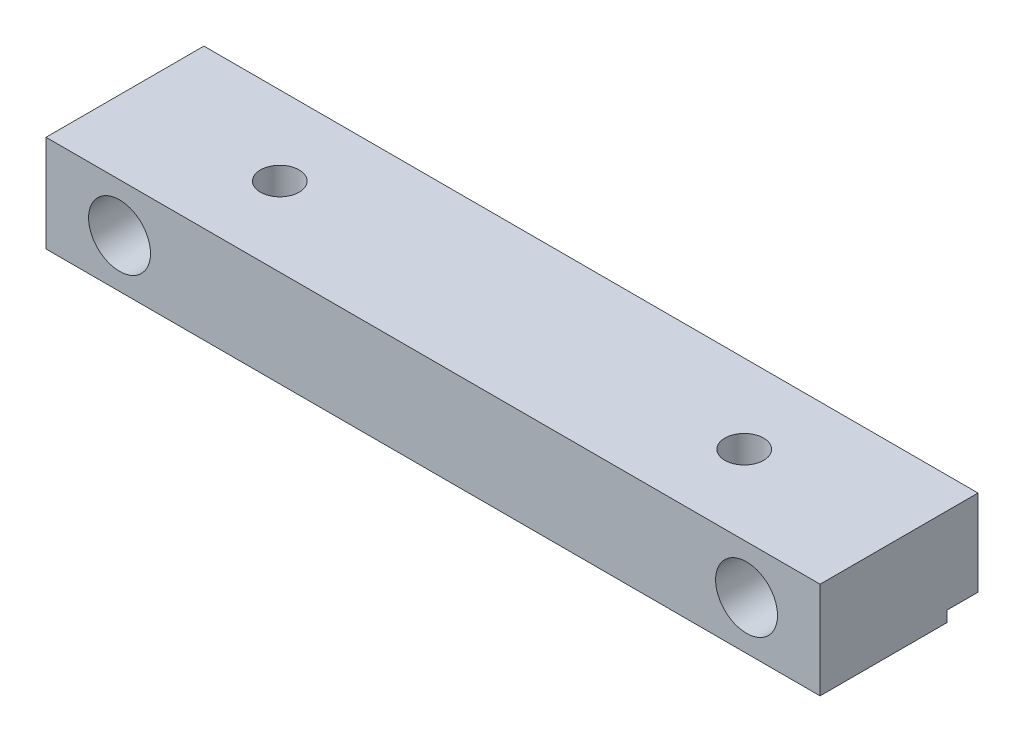
ISO-10303-21;
HEADER;
FILE_DESCRIPTION(('STEP AP214'),'2;1');
FILE_NAME('part.step','',(''),(''),'','','');
FILE_SCHEMA(('AUTOMOTIVE_DESIGN { 1 0 10303 214 1 1 1 1 }'));
ENDSEC;
DATA;
#1=APPLICATION_CONTEXT('core data for automotive mechanical design processes');
#2=APPLICATION_PROTOCOL_DEFINITION('international standard','automotive_design',2000,#1);
#3=PRODUCT_CONTEXT('',#1,'mechanical');
#4=PRODUCT('Part','Part','',(#3));
#5=PRODUCT_RELATED_PRODUCT_CATEGORY('part','',(#4));
#6=PRODUCT_DEFINITION_FORMATION('','',#4);
#7=PRODUCT_DEFINITION_CONTEXT('part definition',#1,'design');
#8=PRODUCT_DEFINITION('design','',#6,#7);
#9=PRODUCT_DEFINITION_SHAPE('','',#8);
#10=(LENGTH_UNIT() NAMED_UNIT(*) SI_UNIT(.MILLI.,.METRE.));
#11=(NAMED_UNIT(*) PLANE_ANGLE_UNIT() SI_UNIT($,.RADIAN.));
#12=(NAMED_UNIT(*) SI_UNIT($,.STERADIAN.) SOLID_ANGLE_UNIT());
#13=UNCERTAINTY_MEASURE_WITH_UNIT(LENGTH_MEASURE(1.E-05),#10,'distance_accuracy_value','');
#14=(GEOMETRIC_REPRESENTATION_CONTEXT(3) GLOBAL_UNCERTAINTY_ASSIGNED_CONTEXT((#13)) GLOBAL_UNIT_ASSIGNED_CONTEXT((#10,
#11,#12)) REPRESENTATION_CONTEXT('',''));
#15=CARTESIAN_POINT('',(0.,0.,0.));
#16=DIRECTION('',(0.,0.,1.));
#17=DIRECTION('',(1.,0.,0.));
#18=AXIS2_PLACEMENT_3D('',#15,#16,#17);
#19=CARTESIAN_POINT('',(0.,6.25,0.));
#20=DIRECTION('',(1.,0.,0.));
#21=DIRECTION('',(0.,0.,-1.));
#22=AXIS2_PLACEMENT_3D('',#19,#20,#21);
#23=PLANE('',#22);
#24=DIRECTION('',(0.,0.,1.));
#25=VECTOR('',#24,1.);
#26=CARTESIAN_POINT('',(0.,0.7,-10.2));
#27=LINE('',#26,#25);
#28=CARTESIAN_POINT('',(0.,0.7,-10.2));
#29=VERTEX_POINT('',#28);
#30=CARTESIAN_POINT('',(0.,0.7,-8.2));
#31=VERTEX_POINT('',#30);
#32=EDGE_CURVE('E89',#29,#31,#27,.T.);
#33=ORIENTED_EDGE('',*,*,#32,.T.);
#34=DIRECTION('',(0.,-1.,0.));
#35=VECTOR('',#34,1.);
#36=CARTESIAN_POINT('',(0.,0.,-8.2));
#37=LINE('',#36,#35);
#38=CARTESIAN_POINT('',(0.,0.,-8.2));
#39=VERTEX_POINT('',#38);
#40=EDGE_CURVE('E100',#31,#39,#37,.T.);
#41=ORIENTED_EDGE('',*,*,#40,.T.);
#42=DIRECTION('',(0.,0.,1.));
#43=VECTOR('',#42,1.);
#44=CARTESIAN_POINT('',(0.,0.,0.));
#45=LINE('',#44,#43);
#46=CARTESIAN_POINT('',(0.,0.,0.));
#47=VERTEX_POINT('',#46);
#48=EDGE_CURVE('E130',#39,#47,#45,.T.);
#49=ORIENTED_EDGE('',*,*,#48,.T.);
#50=DIRECTION('',(0.,-1.,0.));
#51=VECTOR('',#50,1.);
#52=CARTESIAN_POINT('',(0.,6.25,0.));
#53=LINE('',#52,#51);
#54=CARTESIAN_POINT('',(0.,6.25,0.));
#55=VERTEX_POINT('',#54);
#56=EDGE_CURVE('E11',#55,#47,#53,.T.);
#57=ORIENTED_EDGE('',*,*,#56,.F.);
#58=DIRECTION('',(0.,0.,1.));
#59=VECTOR('',#58,1.);
#60=CARTESIAN_POINT('',(0.,6.25,0.));
#61=LINE('',#60,#59);
#62=CARTESIAN_POINT('',(0.,6.25,-10.2));
#63=VERTEX_POINT('',#62);
#64=EDGE_CURVE('E111',#63,#55,#61,.T.);
#65=ORIENTED_EDGE('',*,*,#64,.F.);
#66=DIRECTION('',(0.,-1.,0.));
#67=VECTOR('',#66,1.);
#68=CARTESIAN_POINT('',(0.,6.25,-10.2));
#69=LINE('',#68,#67);
#70=EDGE_CURVE('E105',#63,#29,#69,.T.);
#71=ORIENTED_EDGE('',*,*,#70,.T.);
#72=EDGE_LOOP('',(#33,#41,#49,#57,#65,#71));
#73=FACE_BOUND('',#72,.T.);
#74=ADVANCED_FACE('F31',(#73),#23,.F.);
#75=CARTESIAN_POINT('',(0.,6.25,0.));
#76=DIRECTION('',(0.,0.,-1.));
#77=DIRECTION('',(-1.,0.,0.));
#78=AXIS2_PLACEMENT_3D('',#75,#76,#77);
#79=PLANE('',#78);
#80=CARTESIAN_POINT('',(4.75,3.125,0.));
#81=DIRECTION('',(0.,0.,1.));
#82=DIRECTION('',(1.,0.,0.));
#83=AXIS2_PLACEMENT_3D('',#80,#81,#82);
#84=CIRCLE('',#83,2.);
#85=CARTESIAN_POINT('',(6.75,3.125,0.));
#86=VERTEX_POINT('',#85);
#87=EDGE_CURVE('E144',#86,#86,#84,.T.);
#88=ORIENTED_EDGE('',*,*,#87,.F.);
#89=EDGE_LOOP('',(#88));
#90=FACE_BOUND('',#89,.T.);
#91=CARTESIAN_POINT('',(45.25,3.125,0.));
#92=DIRECTION('',(0.,0.,1.));
#93=DIRECTION('',(1.,0.,0.));
#94=AXIS2_PLACEMENT_3D('',#91,#92,#93);
#95=CIRCLE('',#94,2.);
#96=CARTESIAN_POINT('',(47.25,3.125,0.));
#97=VERTEX_POINT('',#96);
#98=EDGE_CURVE('E138',#97,#97,#95,.T.);
#99=ORIENTED_EDGE('',*,*,#98,.F.);
#100=EDGE_LOOP('',(#99));
#101=FACE_BOUND('',#100,.T.);
#102=DIRECTION('',(1.,0.,0.));
#103=VECTOR('',#102,1.);
#104=CARTESIAN_POINT('',(0.,0.,0.));
#105=LINE('',#104,#103);
#106=CARTESIAN_POINT('',(50.,0.,0.));
#107=VERTEX_POINT('',#106);
#108=EDGE_CURVE('E69',#47,#107,#105,.T.);
#109=ORIENTED_EDGE('',*,*,#108,.T.);
#110=DIRECTION('',(0.,-1.,0.));
#111=VECTOR('',#110,1.);
#112=CARTESIAN_POINT('',(50.,6.25,0.));
#113=LINE('',#112,#111);
#114=CARTESIAN_POINT('',(50.,6.25,0.));
#115=VERTEX_POINT('',#114);
#116=EDGE_CURVE('E38',#115,#107,#113,.T.);
#117=ORIENTED_EDGE('',*,*,#116,.F.);
#118=DIRECTION('',(1.,0.,0.));
#119=VECTOR('',#118,1.);
#120=CARTESIAN_POINT('',(0.,6.25,0.));
#121=LINE('',#120,#119);
#122=EDGE_CURVE('E74',#55,#115,#121,.T.);
#123=ORIENTED_EDGE('',*,*,#122,.F.);
#124=ORIENTED_EDGE('',*,*,#56,.T.);
#125=EDGE_LOOP('',(#109,#117,#123,#124));
#126=FACE_BOUND('',#125,.T.);
#127=ADVANCED_FACE('F177',(#90,#101,#126),#79,.F.);
#128=CARTESIAN_POINT('',(50.,6.25,0.));
#129=DIRECTION('',(-1.,0.,0.));
#130=DIRECTION('',(0.,0.,1.));
#131=AXIS2_PLACEMENT_3D('',#128,#129,#130);
#132=PLANE('',#131);
#133=DIRECTION('',(0.,0.,-1.));
#134=VECTOR('',#133,1.);
#135=CARTESIAN_POINT('',(50.,0.,0.));
#136=LINE('',#135,#134);
#137=CARTESIAN_POINT('',(50.,0.,-8.2));
#138=VERTEX_POINT('',#137);
#139=EDGE_CURVE('E117',#107,#138,#136,.T.);
#140=ORIENTED_EDGE('',*,*,#139,.T.);
#141=DIRECTION('',(0.,-1.,0.));
#142=VECTOR('',#141,1.);
#143=CARTESIAN_POINT('',(50.,0.,-8.2));
#144=LINE('',#143,#142);
#145=CARTESIAN_POINT('',(50.,0.7,-8.2));
#146=VERTEX_POINT('',#145);
#147=EDGE_CURVE('E45',#146,#138,#144,.T.);
#148=ORIENTED_EDGE('',*,*,#147,.F.);
#149=DIRECTION('',(0.,0.,1.));
#150=VECTOR('',#149,1.);
#151=CARTESIAN_POINT('',(50.,0.7,-10.2));
#152=LINE('',#151,#150);
#153=CARTESIAN_POINT('',(50.,0.7,-10.2));
#154=VERTEX_POINT('',#153);
#155=EDGE_CURVE('E162',#154,#146,#152,.T.);
#156=ORIENTED_EDGE('',*,*,#155,.F.);
#157=DIRECTION('',(0.,-1.,0.));
#158=VECTOR('',#157,1.);
#159=CARTESIAN_POINT('',(50.,6.25,-10.2));
#160=LINE('',#159,#158);
#161=CARTESIAN_POINT('',(50.,6.25,-10.2));
#162=VERTEX_POINT('',#161);
#163=EDGE_CURVE('E108',#162,#154,#160,.T.);
#164=ORIENTED_EDGE('',*,*,#163,.F.);
#165=DIRECTION('',(0.,0.,-1.));
#166=VECTOR('',#165,1.);
#167=CARTESIAN_POINT('',(50.,6.25,0.));
#168=LINE('',#167,#166);
#169=EDGE_CURVE('E114',#115,#162,#168,.T.);
#170=ORIENTED_EDGE('',*,*,#169,.F.);
#171=ORIENTED_EDGE('',*,*,#116,.T.);
#172=EDGE_LOOP('',(#140,#148,#156,#164,#170,#171));
#173=FACE_BOUND('',#172,.T.);
#174=ADVANCED_FACE('F123',(#173),#132,.F.);
#175=CARTESIAN_POINT('',(0.,6.25,-10.2));
#176=DIRECTION('',(0.,0.,1.));
#177=DIRECTION('',(1.,0.,0.));
#178=AXIS2_PLACEMENT_3D('',#175,#176,#177);
#179=PLANE('',#178);
#180=CARTESIAN_POINT('',(4.75,3.125,-10.2));
#181=DIRECTION('',(0.,0.,1.));
#182=DIRECTION('',(1.,0.,0.));
#183=AXIS2_PLACEMENT_3D('',#180,#181,#182);
#184=CIRCLE('',#183,2.);
#185=CARTESIAN_POINT('',(6.75,3.125,-10.2));
#186=VERTEX_POINT('',#185);
#187=EDGE_CURVE('E141',#186,#186,#184,.T.);
#188=ORIENTED_EDGE('',*,*,#187,.T.);
#189=EDGE_LOOP('',(#188));
#190=FACE_BOUND('',#189,.T.);
#191=CARTESIAN_POINT('',(45.25,3.125,-10.2));
#192=DIRECTION('',(0.,0.,1.));
#193=DIRECTION('',(1.,0.,0.));
#194=AXIS2_PLACEMENT_3D('',#191,#192,#193);
#195=CIRCLE('',#194,1.99999999999999);
#196=CARTESIAN_POINT('',(47.25,3.125,-10.2));
#197=VERTEX_POINT('',#196);
#198=EDGE_CURVE('E131',#197,#197,#195,.T.);
#199=ORIENTED_EDGE('',*,*,#198,.T.);
#200=EDGE_LOOP('',(#199));
#201=FACE_BOUND('',#200,.T.);
#202=ORIENTED_EDGE('',*,*,#163,.T.);
#203=DIRECTION('',(1.,0.,0.));
#204=VECTOR('',#203,1.);
#205=CARTESIAN_POINT('',(0.,0.7,-10.2));
#206=LINE('',#205,#204);
#207=EDGE_CURVE('E93',#29,#154,#206,.T.);
#208=ORIENTED_EDGE('',*,*,#207,.F.);
#209=ORIENTED_EDGE('',*,*,#70,.F.);
#210=DIRECTION('',(-1.,0.,0.));
#211=VECTOR('',#210,1.);
#212=CARTESIAN_POINT('',(0.,6.25,-10.2));
#213=LINE('',#212,#211);
#214=EDGE_CURVE('E54',#162,#63,#213,.T.);
#215=ORIENTED_EDGE('',*,*,#214,.F.);
#216=EDGE_LOOP('',(#202,#208,#209,#215));
#217=FACE_BOUND('',#216,.T.);
#218=ADVANCED_FACE('F104',(#190,#201,#217),#179,.F.);
#219=CARTESIAN_POINT('',(0.,6.25,-10.2));
#220=DIRECTION('',(0.,-1.,0.));
#221=DIRECTION('',(0.,0.,-1.));
#222=AXIS2_PLACEMENT_3D('',#219,#220,#221);
#223=PLANE('',#222);
#224=CARTESIAN_POINT('',(10.,6.25,-5.1));
#225=DIRECTION('',(0.,1.,0.));
#226=DIRECTION('',(0.,0.,1.));
#227=AXIS2_PLACEMENT_3D('',#224,#225,#226);
#228=CIRCLE('',#227,1.24999999999999);
#229=CARTESIAN_POINT('',(10.,6.25,-3.85000000000001));
#230=VERTEX_POINT('',#229);
#231=EDGE_CURVE('E156',#230,#230,#228,.T.);
#232=ORIENTED_EDGE('',*,*,#231,.F.);
#233=EDGE_LOOP('',(#232));
#234=FACE_BOUND('',#233,.T.);
#235=CARTESIAN_POINT('',(40.,6.25,-5.1));
#236=DIRECTION('',(0.,1.,0.));
#237=DIRECTION('',(0.,0.,1.));
#238=AXIS2_PLACEMENT_3D('',#235,#236,#237);
#239=CIRCLE('',#238,1.24999999999999);
#240=CARTESIAN_POINT('',(40.,6.25,-3.85000000000001));
#241=VERTEX_POINT('',#240);
#242=EDGE_CURVE('E150',#241,#241,#239,.T.);
#243=ORIENTED_EDGE('',*,*,#242,.F.);
#244=EDGE_LOOP('',(#243));
#245=FACE_BOUND('',#244,.T.);
#246=ORIENTED_EDGE('',*,*,#64,.T.);
#247=ORIENTED_EDGE('',*,*,#122,.T.);
#248=ORIENTED_EDGE('',*,*,#169,.T.);
#249=ORIENTED_EDGE('',*,*,#214,.T.);
#250=EDGE_LOOP('',(#246,#247,#248,#249));
#251=FACE_BOUND('',#250,.T.);
#252=ADVANCED_FACE('F191',(#234,#245,#251),#223,.F.);
#253=CARTESIAN_POINT('',(0.,0.,-10.2));
#254=DIRECTION('',(0.,-1.,0.));
#255=DIRECTION('',(0.,0.,-1.));
#256=AXIS2_PLACEMENT_3D('',#253,#254,#255);
#257=PLANE('',#256);
#258=DIRECTION('',(1.,0.,0.));
#259=VECTOR('',#258,1.);
#260=CARTESIAN_POINT('',(0.,0.,-8.2));
#261=LINE('',#260,#259);
#262=EDGE_CURVE('E128',#39,#138,#261,.T.);
#263=ORIENTED_EDGE('',*,*,#262,.T.);
#264=ORIENTED_EDGE('',*,*,#139,.F.);
#265=ORIENTED_EDGE('',*,*,#108,.F.);
#266=ORIENTED_EDGE('',*,*,#48,.F.);
#267=EDGE_LOOP('',(#263,#264,#265,#266));
#268=FACE_BOUND('',#267,.T.);
#269=CARTESIAN_POINT('',(10.,0.,-5.1));
#270=DIRECTION('',(0.,1.,0.));
#271=DIRECTION('',(0.,0.,1.));
#272=AXIS2_PLACEMENT_3D('',#269,#270,#271);
#273=CIRCLE('',#272,1.25);
#274=CARTESIAN_POINT('',(10.,0.,-3.85));
#275=VERTEX_POINT('',#274);
#276=EDGE_CURVE('E153',#275,#275,#273,.T.);
#277=ORIENTED_EDGE('',*,*,#276,.T.);
#278=EDGE_LOOP('',(#277));
#279=FACE_BOUND('',#278,.T.);
#280=CARTESIAN_POINT('',(40.,0.,-5.1));
#281=DIRECTION('',(0.,1.,0.));
#282=DIRECTION('',(0.,0.,1.));
#283=AXIS2_PLACEMENT_3D('',#280,#281,#282);
#284=CIRCLE('',#283,1.25);
#285=CARTESIAN_POINT('',(40.,0.,-3.85));
#286=VERTEX_POINT('',#285);
#287=EDGE_CURVE('E147',#286,#286,#284,.T.);
#288=ORIENTED_EDGE('',*,*,#287,.T.);
#289=EDGE_LOOP('',(#288));
#290=FACE_BOUND('',#289,.T.);
#291=ADVANCED_FACE('F125',(#268,#279,#290),#257,.T.);
#292=CARTESIAN_POINT('',(45.25,3.125,0.));
#293=DIRECTION('',(0.,0.,1.));
#294=DIRECTION('',(1.,0.,0.));
#295=AXIS2_PLACEMENT_3D('',#292,#293,#294);
#296=CYLINDRICAL_SURFACE('',#295,2.);
#297=ORIENTED_EDGE('',*,*,#198,.F.);
#298=EDGE_LOOP('',(#297));
#299=FACE_BOUND('',#298,.T.);
#300=ORIENTED_EDGE('',*,*,#98,.T.);
#301=EDGE_LOOP('',(#300));
#302=FACE_BOUND('',#301,.T.);
#303=ADVANCED_FACE('F195',(#299,#302),#296,.F.);
#304=CARTESIAN_POINT('',(4.75,3.125,0.));
#305=DIRECTION('',(0.,0.,1.));
#306=DIRECTION('',(1.,0.,0.));
#307=AXIS2_PLACEMENT_3D('',#304,#305,#306);
#308=CYLINDRICAL_SURFACE('',#307,2.);
#309=ORIENTED_EDGE('',*,*,#187,.F.);
#310=EDGE_LOOP('',(#309));
#311=FACE_BOUND('',#310,.T.);
#312=ORIENTED_EDGE('',*,*,#87,.T.);
#313=EDGE_LOOP('',(#312));
#314=FACE_BOUND('',#313,.T.);
#315=ADVANCED_FACE('F201',(#311,#314),#308,.F.);
#316=CARTESIAN_POINT('',(40.,6.25,-5.1));
#317=DIRECTION('',(0.,1.,0.));
#318=DIRECTION('',(0.,0.,1.));
#319=AXIS2_PLACEMENT_3D('',#316,#317,#318);
#320=CYLINDRICAL_SURFACE('',#319,1.24999999999999);
#321=ORIENTED_EDGE('',*,*,#287,.F.);
#322=EDGE_LOOP('',(#321));
#323=FACE_BOUND('',#322,.T.);
#324=ORIENTED_EDGE('',*,*,#242,.T.);
#325=EDGE_LOOP('',(#324));
#326=FACE_BOUND('',#325,.T.);
#327=ADVANCED_FACE('F173',(#323,#326),#320,.F.);
#328=CARTESIAN_POINT('',(10.,6.25,-5.1));
#329=DIRECTION('',(0.,1.,0.));
#330=DIRECTION('',(0.,0.,1.));
#331=AXIS2_PLACEMENT_3D('',#328,#329,#330);
#332=CYLINDRICAL_SURFACE('',#331,1.24999999999999);
#333=ORIENTED_EDGE('',*,*,#276,.F.);
#334=EDGE_LOOP('',(#333));
#335=FACE_BOUND('',#334,.T.);
#336=ORIENTED_EDGE('',*,*,#231,.T.);
#337=EDGE_LOOP('',(#336));
#338=FACE_BOUND('',#337,.T.);
#339=ADVANCED_FACE('F166',(#335,#338),#332,.F.);
#340=CARTESIAN_POINT('',(0.,0.,-8.2));
#341=DIRECTION('',(0.,0.,1.));
#342=DIRECTION('',(1.,0.,0.));
#343=AXIS2_PLACEMENT_3D('',#340,#341,#342);
#344=PLANE('',#343);
#345=ORIENTED_EDGE('',*,*,#147,.T.);
#346=ORIENTED_EDGE('',*,*,#262,.F.);
#347=ORIENTED_EDGE('',*,*,#40,.F.);
#348=DIRECTION('',(1.,0.,0.));
#349=VECTOR('',#348,1.);
#350=CARTESIAN_POINT('',(0.,0.7,-8.2));
#351=LINE('',#350,#349);
#352=EDGE_CURVE('E95',#31,#146,#351,.T.);
#353=ORIENTED_EDGE('',*,*,#352,.T.);
#354=EDGE_LOOP('',(#345,#346,#347,#353));
#355=FACE_BOUND('',#354,.T.);
#356=ADVANCED_FACE('F164',(#355),#344,.F.);
#357=CARTESIAN_POINT('',(0.,0.7,-10.2));
#358=DIRECTION('',(0.,1.,0.));
#359=DIRECTION('',(0.,0.,1.));
#360=AXIS2_PLACEMENT_3D('',#357,#358,#359);
#361=PLANE('',#360);
#362=ORIENTED_EDGE('',*,*,#155,.T.);
#363=ORIENTED_EDGE('',*,*,#352,.F.);
#364=ORIENTED_EDGE('',*,*,#32,.F.);
#365=ORIENTED_EDGE('',*,*,#207,.T.);
#366=EDGE_LOOP('',(#362,#363,#364,#365));
#367=FACE_BOUND('',#366,.T.);
#368=ADVANCED_FACE('F92',(#367),#361,.F.);
#369=CLOSED_SHELL('',(#74,#127,#174,#218,#252,#291,#303,#315,#327,#339,#356,#368));
#370=MANIFOLD_SOLID_BREP('B2',#369);
#371=ADVANCED_BREP_SHAPE_REPRESENTATION('',(#18,#370),#14);
#372=SHAPE_DEFINITION_REPRESENTATION(#9,#371);
ENDSEC;
END-ISO-10303-21;
